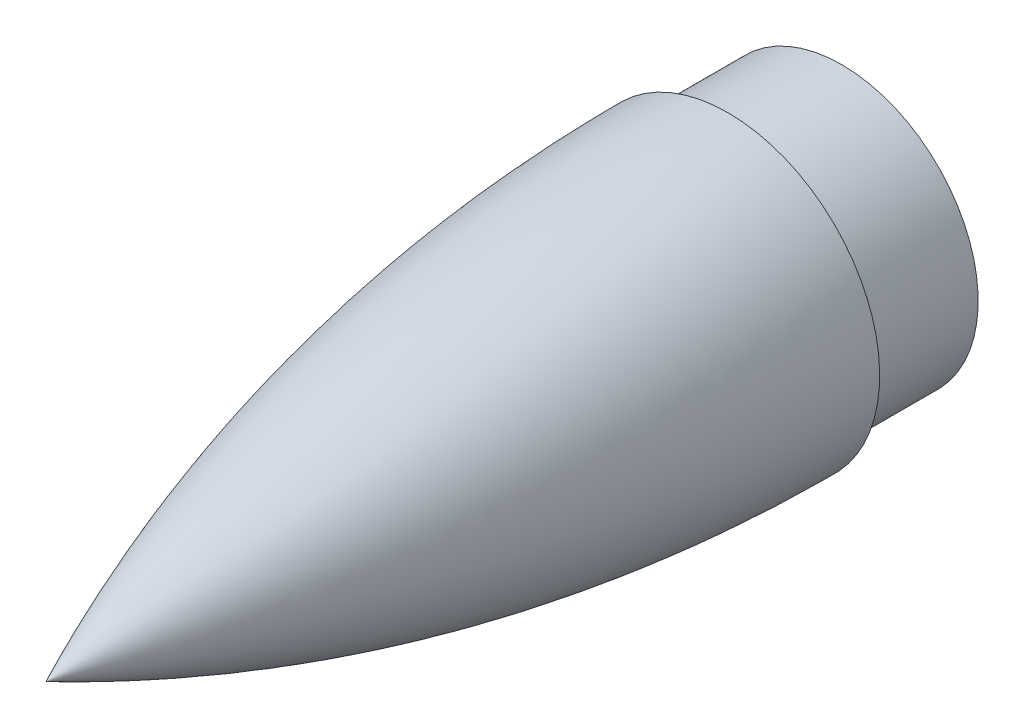
ISO-10303-21;
HEADER;
FILE_DESCRIPTION(('STEP AP214'),'2;1');
FILE_NAME('part.step','',(''),(''),'','','');
FILE_SCHEMA(('AUTOMOTIVE_DESIGN { 1 0 10303 214 1 1 1 1 }'));
ENDSEC;
DATA;
#1=APPLICATION_CONTEXT('core data for automotive mechanical design processes');
#2=APPLICATION_PROTOCOL_DEFINITION('international standard','automotive_design',2000,#1);
#3=PRODUCT_CONTEXT('',#1,'mechanical');
#4=PRODUCT('Part','Part','',(#3));
#5=PRODUCT_RELATED_PRODUCT_CATEGORY('part','',(#4));
#6=PRODUCT_DEFINITION_FORMATION('','',#4);
#7=PRODUCT_DEFINITION_CONTEXT('part definition',#1,'design');
#8=PRODUCT_DEFINITION('design','',#6,#7);
#9=PRODUCT_DEFINITION_SHAPE('','',#8);
#10=(LENGTH_UNIT() NAMED_UNIT(*) SI_UNIT(.MILLI.,.METRE.));
#11=(NAMED_UNIT(*) PLANE_ANGLE_UNIT() SI_UNIT($,.RADIAN.));
#12=(NAMED_UNIT(*) SI_UNIT($,.STERADIAN.) SOLID_ANGLE_UNIT());
#13=UNCERTAINTY_MEASURE_WITH_UNIT(LENGTH_MEASURE(1.E-05),#10,'distance_accuracy_value','');
#14=(GEOMETRIC_REPRESENTATION_CONTEXT(3) GLOBAL_UNCERTAINTY_ASSIGNED_CONTEXT((#13)) GLOBAL_UNIT_ASSIGNED_CONTEXT((#10,
#11,#12)) REPRESENTATION_CONTEXT('',''));
#15=CARTESIAN_POINT('',(0.,0.,0.));
#16=DIRECTION('',(0.,0.,1.));
#17=DIRECTION('',(1.,0.,0.));
#18=AXIS2_PLACEMENT_3D('',#15,#16,#17);
#19=CARTESIAN_POINT('',(0.,17.9999999996683,-104.999999999042));
#20=DIRECTION('',(0.,0.,-1.));
#21=DIRECTION('',(0.,1.,0.));
#22=AXIS2_PLACEMENT_3D('',#19,#20,#21);
#23=PLANE('',#22);
#24=CARTESIAN_POINT('',(0.,-3.31695922744792E-10,-104.999999999042));
#25=DIRECTION('',(0.,0.,-1.));
#26=DIRECTION('',(0.,1.,0.));
#27=AXIS2_PLACEMENT_3D('',#24,#25,#26);
#28=CIRCLE('',#27,18.);
#29=CARTESIAN_POINT('',(0.,17.9999999996683,-104.999999999042));
#30=VERTEX_POINT('',#29);
#31=EDGE_CURVE('E11',#30,#30,#28,.T.);
#32=ORIENTED_EDGE('',*,*,#31,.T.);
#33=EDGE_LOOP('',(#32));
#34=FACE_BOUND('',#33,.T.);
#35=ADVANCED_FACE('F39',(#34),#23,.T.);
#36=CARTESIAN_POINT('',(0.,-3.31695922744792E-10,-104.999999999042));
#37=DIRECTION('',(0.,0.,-1.));
#38=DIRECTION('',(0.,1.,0.));
#39=AXIS2_PLACEMENT_3D('',#36,#37,#38);
#40=CYLINDRICAL_SURFACE('',#39,18.);
#41=CARTESIAN_POINT('',(0.,-3.31697759714991E-10,-90.0000000000452));
#42=DIRECTION('',(0.,0.,-1.));
#43=DIRECTION('',(0.,1.,0.));
#44=AXIS2_PLACEMENT_3D('',#41,#42,#43);
#45=CIRCLE('',#44,18.);
#46=CARTESIAN_POINT('',(0.,17.9999999996683,-90.0000000000452));
#47=VERTEX_POINT('',#46);
#48=EDGE_CURVE('E46',#47,#47,#45,.T.);
#49=ORIENTED_EDGE('',*,*,#48,.T.);
#50=EDGE_LOOP('',(#49));
#51=FACE_BOUND('',#50,.T.);
#52=ORIENTED_EDGE('',*,*,#31,.F.);
#53=EDGE_LOOP('',(#52));
#54=FACE_BOUND('',#53,.T.);
#55=ADVANCED_FACE('F71',(#51,#54),#40,.T.);
#56=CARTESIAN_POINT('',(0.,20.0000000071345,-90.0000000000452));
#57=DIRECTION('',(0.,0.,-1.));
#58=DIRECTION('',(0.,1.,0.));
#59=AXIS2_PLACEMENT_3D('',#56,#57,#58);
#60=PLANE('',#59);
#61=CARTESIAN_POINT('',(0.,-3.31697759714991E-10,-90.0000000000452));
#62=DIRECTION('',(0.,0.,-1.));
#63=DIRECTION('',(0.,1.,0.));
#64=AXIS2_PLACEMENT_3D('',#61,#62,#63);
#65=CIRCLE('',#64,20.0000000074662);
#66=CARTESIAN_POINT('',(0.,20.0000000071345,-90.0000000000452));
#67=VERTEX_POINT('',#66);
#68=EDGE_CURVE('E56',#67,#67,#65,.T.);
#69=ORIENTED_EDGE('',*,*,#68,.T.);
#70=EDGE_LOOP('',(#69));
#71=FACE_BOUND('',#70,.T.);
#72=ORIENTED_EDGE('',*,*,#48,.F.);
#73=EDGE_LOOP('',(#72));
#74=FACE_BOUND('',#73,.T.);
#75=ADVANCED_FACE('F52',(#71,#74),#60,.T.);
#76=CARTESIAN_POINT('',(0.,20.0000000071345,-90.0000000000679));
#77=CARTESIAN_POINT('',(0.,19.999999507455,-79.9999999998706));
#78=CARTESIAN_POINT('',(0.,19.4705903623913,-69.9999999996917));
#79=CARTESIAN_POINT('',(0.,18.4117591158275,-59.9999999995312));
#80=CARTESIAN_POINT('',(0.,16.8167575294301,-49.9999999993893));
#81=CARTESIAN_POINT('',(0.,14.6719470026597,-39.9999999992665));
#82=CARTESIAN_POINT('',(0.,11.9561958582635,-29.9999999991636));
#83=CARTESIAN_POINT('',(0.,8.63849190272496,-19.9999999990815));
#84=CARTESIAN_POINT('',(0.,4.67532388790729,-9.99999999902193));
#85=CARTESIAN_POINT('',(0.,-3.57229599633885E-10,1.0129524172578E-09));
#86=B_SPLINE_CURVE_WITH_KNOTS('',9,(#76,#77,#78,#79,#80,#81,#82,#83,#84,#85),.UNSPECIFIED.,.F.,
.F.,(10,10),(0.0773995556390898,0.916127232336267),.UNSPECIFIED.);
#87=CARTESIAN_POINT('',(0.,-3.31695922744792E-10,-104.999999999042));
#88=DIRECTION('',(0.,0.,-1.));
#89=AXIS1_PLACEMENT('',#87,#88);
#90=SURFACE_OF_REVOLUTION('',#86,#89);
#91=CARTESIAN_POINT('',(0.,-3.57229599633885E-10,1.0129524172578E-09));
#92=VERTEX_POINT('',#91);
#93=VERTEX_LOOP('',#92);
#94=FACE_BOUND('',#93,.T.);
#95=ORIENTED_EDGE('',*,*,#68,.F.);
#96=EDGE_LOOP('',(#95));
#97=FACE_BOUND('',#96,.T.);
#98=ADVANCED_FACE('F49',(#94,#97),#90,.F.);
#99=CLOSED_SHELL('',(#35,#55,#75,#98));
#100=MANIFOLD_SOLID_BREP('B2',#99);
#101=ADVANCED_BREP_SHAPE_REPRESENTATION('',(#18,#100),#14);
#102=SHAPE_DEFINITION_REPRESENTATION(#9,#101);
ENDSEC;
END-ISO-10303-21;
